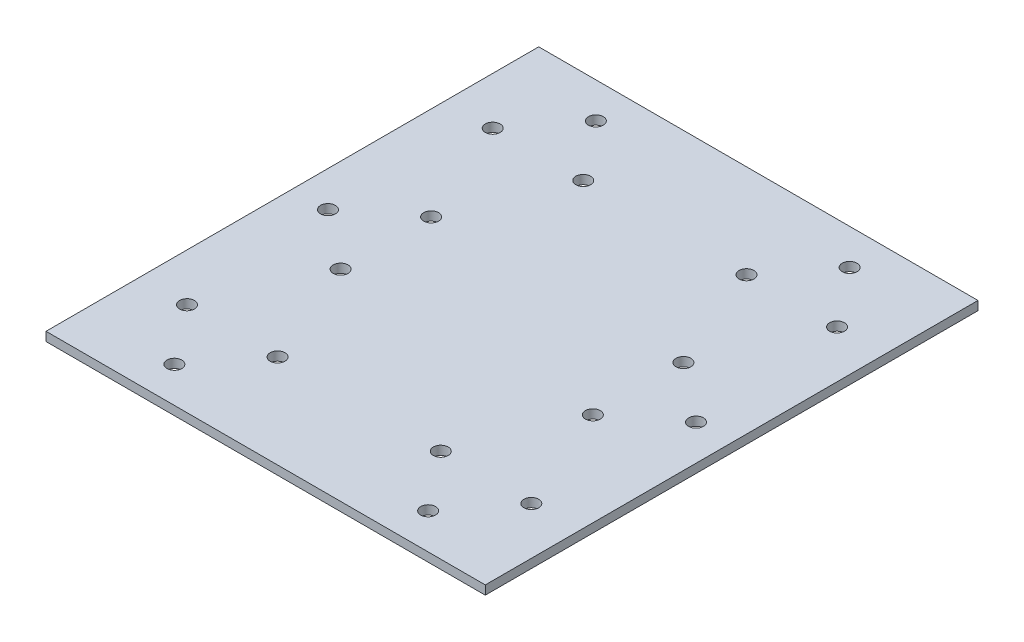
ISO-10303-21;
HEADER;
FILE_DESCRIPTION(('STEP AP214'),'2;1');
FILE_NAME('part.step','',(''),(''),'','','');
FILE_SCHEMA(('AUTOMOTIVE_DESIGN { 1 0 10303 214 1 1 1 1 }'));
ENDSEC;
DATA;
#1=APPLICATION_CONTEXT('core data for automotive mechanical design processes');
#2=APPLICATION_PROTOCOL_DEFINITION('international standard','automotive_design',2000,#1);
#3=PRODUCT_CONTEXT('',#1,'mechanical');
#4=PRODUCT('Part','Part','',(#3));
#5=PRODUCT_RELATED_PRODUCT_CATEGORY('part','',(#4));
#6=PRODUCT_DEFINITION_FORMATION('','',#4);
#7=PRODUCT_DEFINITION_CONTEXT('part definition',#1,'design');
#8=PRODUCT_DEFINITION('design','',#6,#7);
#9=PRODUCT_DEFINITION_SHAPE('','',#8);
#10=(LENGTH_UNIT() NAMED_UNIT(*) SI_UNIT(.MILLI.,.METRE.));
#11=(NAMED_UNIT(*) PLANE_ANGLE_UNIT() SI_UNIT($,.RADIAN.));
#12=(NAMED_UNIT(*) SI_UNIT($,.STERADIAN.) SOLID_ANGLE_UNIT());
#13=UNCERTAINTY_MEASURE_WITH_UNIT(LENGTH_MEASURE(1.E-05),#10,'distance_accuracy_value','');
#14=(GEOMETRIC_REPRESENTATION_CONTEXT(3) GLOBAL_UNCERTAINTY_ASSIGNED_CONTEXT((#13)) GLOBAL_UNIT_ASSIGNED_CONTEXT((#10,
#11,#12)) REPRESENTATION_CONTEXT('',''));
#15=CARTESIAN_POINT('',(0.,0.,0.));
#16=DIRECTION('',(0.,0.,1.));
#17=DIRECTION('',(1.,0.,0.));
#18=AXIS2_PLACEMENT_3D('',#15,#16,#17);
#19=CARTESIAN_POINT('',(-74.,3.,83.));
#20=DIRECTION('',(1.,0.,0.));
#21=DIRECTION('',(0.,0.,-1.));
#22=AXIS2_PLACEMENT_3D('',#19,#20,#21);
#23=PLANE('',#22);
#24=DIRECTION('',(0.,0.,1.));
#25=VECTOR('',#24,1.);
#26=CARTESIAN_POINT('',(-74.,0.,83.));
#27=LINE('',#26,#25);
#28=CARTESIAN_POINT('',(-74.,0.,-83.));
#29=VERTEX_POINT('',#28);
#30=CARTESIAN_POINT('',(-74.,0.,83.));
#31=VERTEX_POINT('',#30);
#32=EDGE_CURVE('E100',#29,#31,#27,.T.);
#33=ORIENTED_EDGE('',*,*,#32,.T.);
#34=DIRECTION('',(0.,-1.,0.));
#35=VECTOR('',#34,1.);
#36=CARTESIAN_POINT('',(-74.,3.,83.));
#37=LINE('',#36,#35);
#38=CARTESIAN_POINT('',(-74.,3.,83.));
#39=VERTEX_POINT('',#38);
#40=EDGE_CURVE('E11',#39,#31,#37,.T.);
#41=ORIENTED_EDGE('',*,*,#40,.F.);
#42=DIRECTION('',(0.,0.,1.));
#43=VECTOR('',#42,1.);
#44=CARTESIAN_POINT('',(-74.,3.,83.));
#45=LINE('',#44,#43);
#46=CARTESIAN_POINT('',(-74.,3.,-83.));
#47=VERTEX_POINT('',#46);
#48=EDGE_CURVE('E88',#47,#39,#45,.T.);
#49=ORIENTED_EDGE('',*,*,#48,.F.);
#50=DIRECTION('',(0.,-1.,0.));
#51=VECTOR('',#50,1.);
#52=CARTESIAN_POINT('',(-74.,3.,-83.));
#53=LINE('',#52,#51);
#54=EDGE_CURVE('E96',#47,#29,#53,.T.);
#55=ORIENTED_EDGE('',*,*,#54,.T.);
#56=EDGE_LOOP('',(#33,#41,#49,#55));
#57=FACE_BOUND('',#56,.T.);
#58=ADVANCED_FACE('F37',(#57),#23,.F.);
#59=CARTESIAN_POINT('',(74.,3.,83.));
#60=DIRECTION('',(0.,0.,-1.));
#61=DIRECTION('',(-1.,0.,0.));
#62=AXIS2_PLACEMENT_3D('',#59,#60,#61);
#63=PLANE('',#62);
#64=DIRECTION('',(1.,0.,0.));
#65=VECTOR('',#64,1.);
#66=CARTESIAN_POINT('',(74.,0.,83.));
#67=LINE('',#66,#65);
#68=CARTESIAN_POINT('',(74.,0.,83.));
#69=VERTEX_POINT('',#68);
#70=EDGE_CURVE('E92',#31,#69,#67,.T.);
#71=ORIENTED_EDGE('',*,*,#70,.T.);
#72=DIRECTION('',(0.,-1.,0.));
#73=VECTOR('',#72,1.);
#74=CARTESIAN_POINT('',(74.,3.,83.));
#75=LINE('',#74,#73);
#76=CARTESIAN_POINT('',(74.,3.,83.));
#77=VERTEX_POINT('',#76);
#78=EDGE_CURVE('E45',#77,#69,#75,.T.);
#79=ORIENTED_EDGE('',*,*,#78,.F.);
#80=DIRECTION('',(1.,0.,0.));
#81=VECTOR('',#80,1.);
#82=CARTESIAN_POINT('',(74.,3.,83.));
#83=LINE('',#82,#81);
#84=EDGE_CURVE('E83',#39,#77,#83,.T.);
#85=ORIENTED_EDGE('',*,*,#84,.F.);
#86=ORIENTED_EDGE('',*,*,#40,.T.);
#87=EDGE_LOOP('',(#71,#79,#85,#86));
#88=FACE_BOUND('',#87,.T.);
#89=ADVANCED_FACE('F91',(#88),#63,.F.);
#90=CARTESIAN_POINT('',(74.,3.,83.));
#91=DIRECTION('',(-1.,0.,0.));
#92=DIRECTION('',(0.,0.,1.));
#93=AXIS2_PLACEMENT_3D('',#90,#91,#92);
#94=PLANE('',#93);
#95=DIRECTION('',(0.,0.,-1.));
#96=VECTOR('',#95,1.);
#97=CARTESIAN_POINT('',(74.,0.,83.));
#98=LINE('',#97,#96);
#99=CARTESIAN_POINT('',(74.,0.,-83.));
#100=VERTEX_POINT('',#99);
#101=EDGE_CURVE('E70',#69,#100,#98,.T.);
#102=ORIENTED_EDGE('',*,*,#101,.T.);
#103=DIRECTION('',(0.,-1.,0.));
#104=VECTOR('',#103,1.);
#105=CARTESIAN_POINT('',(74.,3.,-83.));
#106=LINE('',#105,#104);
#107=CARTESIAN_POINT('',(74.,3.,-83.));
#108=VERTEX_POINT('',#107);
#109=EDGE_CURVE('E93',#108,#100,#106,.T.);
#110=ORIENTED_EDGE('',*,*,#109,.F.);
#111=DIRECTION('',(0.,0.,-1.));
#112=VECTOR('',#111,1.);
#113=CARTESIAN_POINT('',(74.,3.,83.));
#114=LINE('',#113,#112);
#115=EDGE_CURVE('E86',#77,#108,#114,.T.);
#116=ORIENTED_EDGE('',*,*,#115,.F.);
#117=ORIENTED_EDGE('',*,*,#78,.T.);
#118=EDGE_LOOP('',(#102,#110,#116,#117));
#119=FACE_BOUND('',#118,.T.);
#120=ADVANCED_FACE('F94',(#119),#94,.F.);
#121=CARTESIAN_POINT('',(74.,3.,-83.));
#122=DIRECTION('',(0.,0.,1.));
#123=DIRECTION('',(1.,0.,0.));
#124=AXIS2_PLACEMENT_3D('',#121,#122,#123);
#125=PLANE('',#124);
#126=DIRECTION('',(-1.,0.,0.));
#127=VECTOR('',#126,1.);
#128=CARTESIAN_POINT('',(74.,0.,-83.));
#129=LINE('',#128,#127);
#130=EDGE_CURVE('E76',#100,#29,#129,.T.);
#131=ORIENTED_EDGE('',*,*,#130,.T.);
#132=ORIENTED_EDGE('',*,*,#54,.F.);
#133=DIRECTION('',(-1.,0.,0.));
#134=VECTOR('',#133,1.);
#135=CARTESIAN_POINT('',(74.,3.,-83.));
#136=LINE('',#135,#134);
#137=EDGE_CURVE('E53',#108,#47,#136,.T.);
#138=ORIENTED_EDGE('',*,*,#137,.F.);
#139=ORIENTED_EDGE('',*,*,#109,.T.);
#140=EDGE_LOOP('',(#131,#132,#138,#139));
#141=FACE_BOUND('',#140,.T.);
#142=ADVANCED_FACE('F108',(#141),#125,.F.);
#143=CARTESIAN_POINT('',(0.,3.,0.));
#144=DIRECTION('',(0.,1.,0.));
#145=DIRECTION('',(0.,0.,1.));
#146=AXIS2_PLACEMENT_3D('',#143,#144,#145);
#147=PLANE('',#146);
#148=CARTESIAN_POINT('',(27.5,3.,-51.5));
#149=DIRECTION('',(0.,1.,0.));
#150=DIRECTION('',(0.,0.,-1.));
#151=AXIS2_PLACEMENT_3D('',#148,#149,#150);
#152=CIRCLE('',#151,2.5);
#153=CARTESIAN_POINT('',(27.5,3.,-54.));
#154=VERTEX_POINT('',#153);
#155=EDGE_CURVE('E187',#154,#154,#152,.T.);
#156=ORIENTED_EDGE('',*,*,#155,.F.);
#157=EDGE_LOOP('',(#156));
#158=FACE_BOUND('',#157,.T.);
#159=CARTESIAN_POINT('',(58.,3.,-51.5));
#160=DIRECTION('',(0.,1.,0.));
#161=DIRECTION('',(0.,0.,-1.));
#162=AXIS2_PLACEMENT_3D('',#159,#160,#161);
#163=CIRCLE('',#162,2.5);
#164=CARTESIAN_POINT('',(58.,3.,-54.));
#165=VERTEX_POINT('',#164);
#166=EDGE_CURVE('E181',#165,#165,#163,.T.);
#167=ORIENTED_EDGE('',*,*,#166,.F.);
#168=EDGE_LOOP('',(#167));
#169=FACE_BOUND('',#168,.T.);
#170=CARTESIAN_POINT('',(-42.75,3.,-71.));
#171=DIRECTION('',(0.,1.,0.));
#172=DIRECTION('',(0.,0.,1.));
#173=AXIS2_PLACEMENT_3D('',#170,#171,#172);
#174=CIRCLE('',#173,2.5);
#175=CARTESIAN_POINT('',(-42.75,3.,-68.5));
#176=VERTEX_POINT('',#175);
#177=EDGE_CURVE('E175',#176,#176,#174,.T.);
#178=ORIENTED_EDGE('',*,*,#177,.F.);
#179=EDGE_LOOP('',(#178));
#180=FACE_BOUND('',#179,.T.);
#181=CARTESIAN_POINT('',(-42.75,3.,71.));
#182=DIRECTION('',(0.,1.,0.));
#183=DIRECTION('',(0.,0.,-1.));
#184=AXIS2_PLACEMENT_3D('',#181,#182,#183);
#185=CIRCLE('',#184,2.49999999999999);
#186=CARTESIAN_POINT('',(-42.75,3.,68.5));
#187=VERTEX_POINT('',#186);
#188=EDGE_CURVE('E168',#187,#187,#185,.T.);
#189=ORIENTED_EDGE('',*,*,#188,.F.);
#190=EDGE_LOOP('',(#189));
#191=FACE_BOUND('',#190,.T.);
#192=CARTESIAN_POINT('',(42.75,3.,-71.));
#193=DIRECTION('',(0.,1.,0.));
#194=DIRECTION('',(0.,0.,-1.));
#195=AXIS2_PLACEMENT_3D('',#192,#193,#194);
#196=CIRCLE('',#195,2.5);
#197=CARTESIAN_POINT('',(42.75,3.,-73.5));
#198=VERTEX_POINT('',#197);
#199=EDGE_CURVE('E204',#198,#198,#196,.T.);
#200=ORIENTED_EDGE('',*,*,#199,.F.);
#201=EDGE_LOOP('',(#200));
#202=FACE_BOUND('',#201,.T.);
#203=CARTESIAN_POINT('',(42.75,3.,71.));
#204=DIRECTION('',(0.,1.,0.));
#205=DIRECTION('',(0.,0.,1.));
#206=AXIS2_PLACEMENT_3D('',#203,#204,#205);
#207=CIRCLE('',#206,2.49999999999999);
#208=CARTESIAN_POINT('',(42.75,3.,73.5));
#209=VERTEX_POINT('',#208);
#210=EDGE_CURVE('E211',#209,#209,#207,.T.);
#211=ORIENTED_EDGE('',*,*,#210,.F.);
#212=EDGE_LOOP('',(#211));
#213=FACE_BOUND('',#212,.T.);
#214=CARTESIAN_POINT('',(42.5,3.,15.25));
#215=DIRECTION('',(0.,1.,0.));
#216=DIRECTION('',(0.,0.,-1.));
#217=AXIS2_PLACEMENT_3D('',#214,#215,#216);
#218=CIRCLE('',#217,2.5);
#219=CARTESIAN_POINT('',(42.5,3.,12.75));
#220=VERTEX_POINT('',#219);
#221=EDGE_CURVE('E192',#220,#220,#218,.T.);
#222=ORIENTED_EDGE('',*,*,#221,.F.);
#223=EDGE_LOOP('',(#222));
#224=FACE_BOUND('',#223,.T.);
#225=CARTESIAN_POINT('',(42.5,3.,-15.25));
#226=DIRECTION('',(0.,1.,0.));
#227=DIRECTION('',(0.,0.,-1.));
#228=AXIS2_PLACEMENT_3D('',#225,#226,#227);
#229=CIRCLE('',#228,2.49999999999999);
#230=CARTESIAN_POINT('',(42.5,3.,-17.75));
#231=VERTEX_POINT('',#230);
#232=EDGE_CURVE('E199',#231,#231,#229,.T.);
#233=ORIENTED_EDGE('',*,*,#232,.F.);
#234=EDGE_LOOP('',(#233));
#235=FACE_BOUND('',#234,.T.);
#236=CARTESIAN_POINT('',(27.5,3.,51.5));
#237=DIRECTION('',(0.,1.,0.));
#238=DIRECTION('',(0.,0.,1.));
#239=AXIS2_PLACEMENT_3D('',#236,#237,#238);
#240=CIRCLE('',#239,2.5);
#241=CARTESIAN_POINT('',(27.5,3.,54.));
#242=VERTEX_POINT('',#241);
#243=EDGE_CURVE('E120',#242,#242,#240,.T.);
#244=ORIENTED_EDGE('',*,*,#243,.F.);
#245=EDGE_LOOP('',(#244));
#246=FACE_BOUND('',#245,.T.);
#247=CARTESIAN_POINT('',(58.,3.,51.5));
#248=DIRECTION('',(0.,1.,0.));
#249=DIRECTION('',(0.,0.,1.));
#250=AXIS2_PLACEMENT_3D('',#247,#248,#249);
#251=CIRCLE('',#250,2.5);
#252=CARTESIAN_POINT('',(58.,3.,54.));
#253=VERTEX_POINT('',#252);
#254=EDGE_CURVE('E127',#253,#253,#251,.T.);
#255=ORIENTED_EDGE('',*,*,#254,.F.);
#256=EDGE_LOOP('',(#255));
#257=FACE_BOUND('',#256,.T.);
#258=CARTESIAN_POINT('',(-58.,3.,51.5));
#259=DIRECTION('',(0.,1.,0.));
#260=DIRECTION('',(0.,0.,-1.));
#261=AXIS2_PLACEMENT_3D('',#258,#259,#260);
#262=CIRCLE('',#261,2.5);
#263=CARTESIAN_POINT('',(-58.,3.,49.));
#264=VERTEX_POINT('',#263);
#265=EDGE_CURVE('E133',#264,#264,#262,.T.);
#266=ORIENTED_EDGE('',*,*,#265,.F.);
#267=EDGE_LOOP('',(#266));
#268=FACE_BOUND('',#267,.T.);
#269=CARTESIAN_POINT('',(-27.5,3.,51.5));
#270=DIRECTION('',(0.,1.,0.));
#271=DIRECTION('',(0.,0.,-1.));
#272=AXIS2_PLACEMENT_3D('',#269,#270,#271);
#273=CIRCLE('',#272,2.5);
#274=CARTESIAN_POINT('',(-27.5,3.,49.));
#275=VERTEX_POINT('',#274);
#276=EDGE_CURVE('E139',#275,#275,#273,.T.);
#277=ORIENTED_EDGE('',*,*,#276,.F.);
#278=EDGE_LOOP('',(#277));
#279=FACE_BOUND('',#278,.T.);
#280=CARTESIAN_POINT('',(-27.5,3.,-51.5));
#281=DIRECTION('',(0.,1.,0.));
#282=DIRECTION('',(0.,0.,1.));
#283=AXIS2_PLACEMENT_3D('',#280,#281,#282);
#284=CIRCLE('',#283,2.50000000000001);
#285=CARTESIAN_POINT('',(-27.5,3.,-49.));
#286=VERTEX_POINT('',#285);
#287=EDGE_CURVE('E153',#286,#286,#284,.T.);
#288=ORIENTED_EDGE('',*,*,#287,.F.);
#289=EDGE_LOOP('',(#288));
#290=FACE_BOUND('',#289,.T.);
#291=CARTESIAN_POINT('',(-62.,3.,0.));
#292=DIRECTION('',(0.,1.,0.));
#293=DIRECTION('',(0.,0.,1.));
#294=AXIS2_PLACEMENT_3D('',#291,#292,#293);
#295=CIRCLE('',#294,2.5);
#296=CARTESIAN_POINT('',(-62.,3.,2.49999999999999));
#297=VERTEX_POINT('',#296);
#298=EDGE_CURVE('E146',#297,#297,#295,.T.);
#299=ORIENTED_EDGE('',*,*,#298,.F.);
#300=EDGE_LOOP('',(#299));
#301=FACE_BOUND('',#300,.T.);
#302=CARTESIAN_POINT('',(-42.5,3.,15.25));
#303=DIRECTION('',(0.,1.,0.));
#304=DIRECTION('',(0.,0.,1.));
#305=AXIS2_PLACEMENT_3D('',#302,#303,#304);
#306=CIRCLE('',#305,2.5);
#307=CARTESIAN_POINT('',(-42.5,3.,17.75));
#308=VERTEX_POINT('',#307);
#309=EDGE_CURVE('E163',#308,#308,#306,.T.);
#310=ORIENTED_EDGE('',*,*,#309,.F.);
#311=EDGE_LOOP('',(#310));
#312=FACE_BOUND('',#311,.T.);
#313=CARTESIAN_POINT('',(-42.5,3.,-15.25));
#314=DIRECTION('',(0.,1.,0.));
#315=DIRECTION('',(0.,0.,1.));
#316=AXIS2_PLACEMENT_3D('',#313,#314,#315);
#317=CIRCLE('',#316,2.49999999999999);
#318=CARTESIAN_POINT('',(-42.5,3.,-12.75));
#319=VERTEX_POINT('',#318);
#320=EDGE_CURVE('E145',#319,#319,#317,.T.);
#321=ORIENTED_EDGE('',*,*,#320,.F.);
#322=EDGE_LOOP('',(#321));
#323=FACE_BOUND('',#322,.T.);
#324=CARTESIAN_POINT('',(62.,3.,0.));
#325=DIRECTION('',(0.,1.,0.));
#326=DIRECTION('',(0.,0.,-1.));
#327=AXIS2_PLACEMENT_3D('',#324,#325,#326);
#328=CIRCLE('',#327,2.49999999999999);
#329=CARTESIAN_POINT('',(62.,3.,-2.50000000000001));
#330=VERTEX_POINT('',#329);
#331=EDGE_CURVE('E216',#330,#330,#328,.T.);
#332=ORIENTED_EDGE('',*,*,#331,.F.);
#333=EDGE_LOOP('',(#332));
#334=FACE_BOUND('',#333,.T.);
#335=CARTESIAN_POINT('',(-58.,3.,-51.5));
#336=DIRECTION('',(0.,1.,0.));
#337=DIRECTION('',(0.,0.,1.));
#338=AXIS2_PLACEMENT_3D('',#335,#336,#337);
#339=CIRCLE('',#338,2.5);
#340=CARTESIAN_POINT('',(-58.,3.,-49.));
#341=VERTEX_POINT('',#340);
#342=EDGE_CURVE('E114',#341,#341,#339,.T.);
#343=ORIENTED_EDGE('',*,*,#342,.F.);
#344=EDGE_LOOP('',(#343));
#345=FACE_BOUND('',#344,.T.);
#346=ORIENTED_EDGE('',*,*,#48,.T.);
#347=ORIENTED_EDGE('',*,*,#84,.T.);
#348=ORIENTED_EDGE('',*,*,#115,.T.);
#349=ORIENTED_EDGE('',*,*,#137,.T.);
#350=EDGE_LOOP('',(#346,#347,#348,#349));
#351=FACE_BOUND('',#350,.T.);
#352=ADVANCED_FACE('F84',(#158,#169,#180,#191,#202,#213,#224,#235,#246,#257,#268,#279,#290,#301,
#312,#323,#334,#345,#351),#147,.T.);
#353=CARTESIAN_POINT('',(0.,0.,0.));
#354=DIRECTION('',(0.,1.,0.));
#355=DIRECTION('',(0.,0.,1.));
#356=AXIS2_PLACEMENT_3D('',#353,#354,#355);
#357=PLANE('',#356);
#358=CARTESIAN_POINT('',(27.5,0.,-51.5));
#359=DIRECTION('',(0.,1.,0.));
#360=DIRECTION('',(0.,0.,-1.));
#361=AXIS2_PLACEMENT_3D('',#358,#359,#360);
#362=CIRCLE('',#361,2.5);
#363=CARTESIAN_POINT('',(27.5,0.,-54.));
#364=VERTEX_POINT('',#363);
#365=EDGE_CURVE('E124',#364,#364,#362,.T.);
#366=ORIENTED_EDGE('',*,*,#365,.T.);
#367=EDGE_LOOP('',(#366));
#368=FACE_BOUND('',#367,.T.);
#369=CARTESIAN_POINT('',(58.,0.,-51.5));
#370=DIRECTION('',(0.,1.,0.));
#371=DIRECTION('',(0.,0.,-1.));
#372=AXIS2_PLACEMENT_3D('',#369,#370,#371);
#373=CIRCLE('',#372,2.5);
#374=CARTESIAN_POINT('',(58.,0.,-54.));
#375=VERTEX_POINT('',#374);
#376=EDGE_CURVE('E184',#375,#375,#373,.T.);
#377=ORIENTED_EDGE('',*,*,#376,.T.);
#378=EDGE_LOOP('',(#377));
#379=FACE_BOUND('',#378,.T.);
#380=CARTESIAN_POINT('',(-42.75,0.,-71.));
#381=DIRECTION('',(0.,1.,0.));
#382=DIRECTION('',(0.,0.,1.));
#383=AXIS2_PLACEMENT_3D('',#380,#381,#382);
#384=CIRCLE('',#383,2.5);
#385=CARTESIAN_POINT('',(-42.75,0.,-68.5));
#386=VERTEX_POINT('',#385);
#387=EDGE_CURVE('E178',#386,#386,#384,.T.);
#388=ORIENTED_EDGE('',*,*,#387,.T.);
#389=EDGE_LOOP('',(#388));
#390=FACE_BOUND('',#389,.T.);
#391=CARTESIAN_POINT('',(-42.75,0.,71.));
#392=DIRECTION('',(0.,1.,0.));
#393=DIRECTION('',(0.,0.,-1.));
#394=AXIS2_PLACEMENT_3D('',#391,#392,#393);
#395=CIRCLE('',#394,2.49999999999999);
#396=CARTESIAN_POINT('',(-42.75,0.,68.5));
#397=VERTEX_POINT('',#396);
#398=EDGE_CURVE('E171',#397,#397,#395,.T.);
#399=ORIENTED_EDGE('',*,*,#398,.T.);
#400=EDGE_LOOP('',(#399));
#401=FACE_BOUND('',#400,.T.);
#402=CARTESIAN_POINT('',(42.75,0.,-71.));
#403=DIRECTION('',(0.,1.,0.));
#404=DIRECTION('',(0.,0.,-1.));
#405=AXIS2_PLACEMENT_3D('',#402,#403,#404);
#406=CIRCLE('',#405,2.5);
#407=CARTESIAN_POINT('',(42.75,0.,-73.5));
#408=VERTEX_POINT('',#407);
#409=EDGE_CURVE('E207',#408,#408,#406,.T.);
#410=ORIENTED_EDGE('',*,*,#409,.T.);
#411=EDGE_LOOP('',(#410));
#412=FACE_BOUND('',#411,.T.);
#413=CARTESIAN_POINT('',(42.75,0.,71.));
#414=DIRECTION('',(0.,1.,0.));
#415=DIRECTION('',(0.,0.,1.));
#416=AXIS2_PLACEMENT_3D('',#413,#414,#415);
#417=CIRCLE('',#416,2.49999999999999);
#418=CARTESIAN_POINT('',(42.75,0.,73.5));
#419=VERTEX_POINT('',#418);
#420=EDGE_CURVE('E196',#419,#419,#417,.T.);
#421=ORIENTED_EDGE('',*,*,#420,.T.);
#422=EDGE_LOOP('',(#421));
#423=FACE_BOUND('',#422,.T.);
#424=CARTESIAN_POINT('',(42.5,0.,15.25));
#425=DIRECTION('',(0.,1.,0.));
#426=DIRECTION('',(0.,0.,-1.));
#427=AXIS2_PLACEMENT_3D('',#424,#425,#426);
#428=CIRCLE('',#427,2.5);
#429=CARTESIAN_POINT('',(42.5,0.,12.75));
#430=VERTEX_POINT('',#429);
#431=EDGE_CURVE('E195',#430,#430,#428,.T.);
#432=ORIENTED_EDGE('',*,*,#431,.T.);
#433=EDGE_LOOP('',(#432));
#434=FACE_BOUND('',#433,.T.);
#435=CARTESIAN_POINT('',(42.5,0.,-15.25));
#436=DIRECTION('',(0.,1.,0.));
#437=DIRECTION('',(0.,0.,-1.));
#438=AXIS2_PLACEMENT_3D('',#435,#436,#437);
#439=CIRCLE('',#438,2.49999999999999);
#440=CARTESIAN_POINT('',(42.5,0.,-17.75));
#441=VERTEX_POINT('',#440);
#442=EDGE_CURVE('E172',#441,#441,#439,.T.);
#443=ORIENTED_EDGE('',*,*,#442,.T.);
#444=EDGE_LOOP('',(#443));
#445=FACE_BOUND('',#444,.T.);
#446=CARTESIAN_POINT('',(27.5,0.,51.5));
#447=DIRECTION('',(0.,1.,0.));
#448=DIRECTION('',(0.,0.,1.));
#449=AXIS2_PLACEMENT_3D('',#446,#447,#448);
#450=CIRCLE('',#449,2.5);
#451=CARTESIAN_POINT('',(27.5,0.,54.));
#452=VERTEX_POINT('',#451);
#453=EDGE_CURVE('E123',#452,#452,#450,.T.);
#454=ORIENTED_EDGE('',*,*,#453,.T.);
#455=EDGE_LOOP('',(#454));
#456=FACE_BOUND('',#455,.T.);
#457=CARTESIAN_POINT('',(58.,0.,51.5));
#458=DIRECTION('',(0.,1.,0.));
#459=DIRECTION('',(0.,0.,1.));
#460=AXIS2_PLACEMENT_3D('',#457,#458,#459);
#461=CIRCLE('',#460,2.5);
#462=CARTESIAN_POINT('',(58.,0.,54.));
#463=VERTEX_POINT('',#462);
#464=EDGE_CURVE('E130',#463,#463,#461,.T.);
#465=ORIENTED_EDGE('',*,*,#464,.T.);
#466=EDGE_LOOP('',(#465));
#467=FACE_BOUND('',#466,.T.);
#468=CARTESIAN_POINT('',(-58.,0.,51.5));
#469=DIRECTION('',(0.,1.,0.));
#470=DIRECTION('',(0.,0.,-1.));
#471=AXIS2_PLACEMENT_3D('',#468,#469,#470);
#472=CIRCLE('',#471,2.5);
#473=CARTESIAN_POINT('',(-58.,0.,49.));
#474=VERTEX_POINT('',#473);
#475=EDGE_CURVE('E136',#474,#474,#472,.T.);
#476=ORIENTED_EDGE('',*,*,#475,.T.);
#477=EDGE_LOOP('',(#476));
#478=FACE_BOUND('',#477,.T.);
#479=CARTESIAN_POINT('',(-27.5,0.,51.5));
#480=DIRECTION('',(0.,1.,0.));
#481=DIRECTION('',(0.,0.,-1.));
#482=AXIS2_PLACEMENT_3D('',#479,#480,#481);
#483=CIRCLE('',#482,2.5);
#484=CARTESIAN_POINT('',(-27.5,0.,49.));
#485=VERTEX_POINT('',#484);
#486=EDGE_CURVE('E142',#485,#485,#483,.T.);
#487=ORIENTED_EDGE('',*,*,#486,.T.);
#488=EDGE_LOOP('',(#487));
#489=FACE_BOUND('',#488,.T.);
#490=CARTESIAN_POINT('',(-27.5,0.,-51.5));
#491=DIRECTION('',(0.,1.,0.));
#492=DIRECTION('',(0.,0.,1.));
#493=AXIS2_PLACEMENT_3D('',#490,#491,#492);
#494=CIRCLE('',#493,2.50000000000001);
#495=CARTESIAN_POINT('',(-27.5,0.,-49.));
#496=VERTEX_POINT('',#495);
#497=EDGE_CURVE('E117',#496,#496,#494,.T.);
#498=ORIENTED_EDGE('',*,*,#497,.T.);
#499=EDGE_LOOP('',(#498));
#500=FACE_BOUND('',#499,.T.);
#501=CARTESIAN_POINT('',(-62.,0.,0.));
#502=DIRECTION('',(0.,1.,0.));
#503=DIRECTION('',(0.,0.,1.));
#504=AXIS2_PLACEMENT_3D('',#501,#502,#503);
#505=CIRCLE('',#504,2.5);
#506=CARTESIAN_POINT('',(-62.,0.,2.49999999999999));
#507=VERTEX_POINT('',#506);
#508=EDGE_CURVE('E149',#507,#507,#505,.T.);
#509=ORIENTED_EDGE('',*,*,#508,.T.);
#510=EDGE_LOOP('',(#509));
#511=FACE_BOUND('',#510,.T.);
#512=CARTESIAN_POINT('',(-42.5,0.,15.25));
#513=DIRECTION('',(0.,1.,0.));
#514=DIRECTION('',(0.,0.,1.));
#515=AXIS2_PLACEMENT_3D('',#512,#513,#514);
#516=CIRCLE('',#515,2.5);
#517=CARTESIAN_POINT('',(-42.5,0.,17.75));
#518=VERTEX_POINT('',#517);
#519=EDGE_CURVE('E150',#518,#518,#516,.T.);
#520=ORIENTED_EDGE('',*,*,#519,.T.);
#521=EDGE_LOOP('',(#520));
#522=FACE_BOUND('',#521,.T.);
#523=CARTESIAN_POINT('',(-42.5,0.,-15.25));
#524=DIRECTION('',(0.,1.,0.));
#525=DIRECTION('',(0.,0.,1.));
#526=AXIS2_PLACEMENT_3D('',#523,#524,#525);
#527=CIRCLE('',#526,2.49999999999999);
#528=CARTESIAN_POINT('',(-42.5,0.,-12.75));
#529=VERTEX_POINT('',#528);
#530=EDGE_CURVE('E160',#529,#529,#527,.T.);
#531=ORIENTED_EDGE('',*,*,#530,.T.);
#532=EDGE_LOOP('',(#531));
#533=FACE_BOUND('',#532,.T.);
#534=CARTESIAN_POINT('',(62.,0.,0.));
#535=DIRECTION('',(0.,1.,0.));
#536=DIRECTION('',(0.,0.,-1.));
#537=AXIS2_PLACEMENT_3D('',#534,#535,#536);
#538=CIRCLE('',#537,2.49999999999999);
#539=CARTESIAN_POINT('',(62.,0.,-2.50000000000001));
#540=VERTEX_POINT('',#539);
#541=EDGE_CURVE('E208',#540,#540,#538,.T.);
#542=ORIENTED_EDGE('',*,*,#541,.T.);
#543=EDGE_LOOP('',(#542));
#544=FACE_BOUND('',#543,.T.);
#545=CARTESIAN_POINT('',(-58.,0.,-51.5));
#546=DIRECTION('',(0.,1.,0.));
#547=DIRECTION('',(0.,0.,1.));
#548=AXIS2_PLACEMENT_3D('',#545,#546,#547);
#549=CIRCLE('',#548,2.5);
#550=CARTESIAN_POINT('',(-58.,0.,-49.));
#551=VERTEX_POINT('',#550);
#552=EDGE_CURVE('E103',#551,#551,#549,.T.);
#553=ORIENTED_EDGE('',*,*,#552,.T.);
#554=EDGE_LOOP('',(#553));
#555=FACE_BOUND('',#554,.T.);
#556=ORIENTED_EDGE('',*,*,#32,.F.);
#557=ORIENTED_EDGE('',*,*,#130,.F.);
#558=ORIENTED_EDGE('',*,*,#101,.F.);
#559=ORIENTED_EDGE('',*,*,#70,.F.);
#560=EDGE_LOOP('',(#556,#557,#558,#559));
#561=FACE_BOUND('',#560,.T.);
#562=ADVANCED_FACE('F111',(#368,#379,#390,#401,#412,#423,#434,#445,#456,#467,#478,#489,#500,
#511,#522,#533,#544,#555,#561),#357,.F.);
#563=CARTESIAN_POINT('',(-58.,0.,-51.5));
#564=DIRECTION('',(0.,1.,0.));
#565=DIRECTION('',(0.,0.,1.));
#566=AXIS2_PLACEMENT_3D('',#563,#564,#565);
#567=CYLINDRICAL_SURFACE('',#566,2.5);
#568=ORIENTED_EDGE('',*,*,#552,.F.);
#569=EDGE_LOOP('',(#568));
#570=FACE_BOUND('',#569,.T.);
#571=ORIENTED_EDGE('',*,*,#342,.T.);
#572=EDGE_LOOP('',(#571));
#573=FACE_BOUND('',#572,.T.);
#574=ADVANCED_FACE('F228',(#570,#573),#567,.F.);
#575=CARTESIAN_POINT('',(62.,0.,0.));
#576=DIRECTION('',(0.,1.,0.));
#577=DIRECTION('',(0.,0.,1.));
#578=AXIS2_PLACEMENT_3D('',#575,#576,#577);
#579=CYLINDRICAL_SURFACE('',#578,2.49999999999999);
#580=ORIENTED_EDGE('',*,*,#541,.F.);
#581=EDGE_LOOP('',(#580));
#582=FACE_BOUND('',#581,.T.);
#583=ORIENTED_EDGE('',*,*,#331,.T.);
#584=EDGE_LOOP('',(#583));
#585=FACE_BOUND('',#584,.T.);
#586=ADVANCED_FACE('F224',(#582,#585),#579,.F.);
#587=CARTESIAN_POINT('',(-42.5,0.,-15.25));
#588=DIRECTION('',(0.,1.,0.));
#589=DIRECTION('',(0.,0.,1.));
#590=AXIS2_PLACEMENT_3D('',#587,#588,#589);
#591=CYLINDRICAL_SURFACE('',#590,2.49999999999999);
#592=ORIENTED_EDGE('',*,*,#530,.F.);
#593=EDGE_LOOP('',(#592));
#594=FACE_BOUND('',#593,.T.);
#595=ORIENTED_EDGE('',*,*,#320,.T.);
#596=EDGE_LOOP('',(#595));
#597=FACE_BOUND('',#596,.T.);
#598=ADVANCED_FACE('F227',(#594,#597),#591,.F.);
#599=CARTESIAN_POINT('',(-42.5,0.,15.25));
#600=DIRECTION('',(0.,1.,0.));
#601=DIRECTION('',(0.,0.,1.));
#602=AXIS2_PLACEMENT_3D('',#599,#600,#601);
#603=CYLINDRICAL_SURFACE('',#602,2.5);
#604=ORIENTED_EDGE('',*,*,#519,.F.);
#605=EDGE_LOOP('',(#604));
#606=FACE_BOUND('',#605,.T.);
#607=ORIENTED_EDGE('',*,*,#309,.T.);
#608=EDGE_LOOP('',(#607));
#609=FACE_BOUND('',#608,.T.);
#610=ADVANCED_FACE('F289',(#606,#609),#603,.F.);
#611=CARTESIAN_POINT('',(-62.,0.,0.));
#612=DIRECTION('',(0.,1.,0.));
#613=DIRECTION('',(0.,0.,1.));
#614=AXIS2_PLACEMENT_3D('',#611,#612,#613);
#615=CYLINDRICAL_SURFACE('',#614,2.5);
#616=ORIENTED_EDGE('',*,*,#508,.F.);
#617=EDGE_LOOP('',(#616));
#618=FACE_BOUND('',#617,.T.);
#619=ORIENTED_EDGE('',*,*,#298,.T.);
#620=EDGE_LOOP('',(#619));
#621=FACE_BOUND('',#620,.T.);
#622=ADVANCED_FACE('F299',(#618,#621),#615,.F.);
#623=CARTESIAN_POINT('',(-27.5,0.,-51.5));
#624=DIRECTION('',(0.,1.,0.));
#625=DIRECTION('',(0.,0.,1.));
#626=AXIS2_PLACEMENT_3D('',#623,#624,#625);
#627=CYLINDRICAL_SURFACE('',#626,2.50000000000001);
#628=ORIENTED_EDGE('',*,*,#497,.F.);
#629=EDGE_LOOP('',(#628));
#630=FACE_BOUND('',#629,.T.);
#631=ORIENTED_EDGE('',*,*,#287,.T.);
#632=EDGE_LOOP('',(#631));
#633=FACE_BOUND('',#632,.T.);
#634=ADVANCED_FACE('F309',(#630,#633),#627,.F.);
#635=CARTESIAN_POINT('',(-27.5,0.,51.5));
#636=DIRECTION('',(0.,1.,0.));
#637=DIRECTION('',(0.,0.,1.));
#638=AXIS2_PLACEMENT_3D('',#635,#636,#637);
#639=CYLINDRICAL_SURFACE('',#638,2.5);
#640=ORIENTED_EDGE('',*,*,#486,.F.);
#641=EDGE_LOOP('',(#640));
#642=FACE_BOUND('',#641,.T.);
#643=ORIENTED_EDGE('',*,*,#276,.T.);
#644=EDGE_LOOP('',(#643));
#645=FACE_BOUND('',#644,.T.);
#646=ADVANCED_FACE('F319',(#642,#645),#639,.F.);
#647=CARTESIAN_POINT('',(-58.,0.,51.5));
#648=DIRECTION('',(0.,1.,0.));
#649=DIRECTION('',(0.,0.,1.));
#650=AXIS2_PLACEMENT_3D('',#647,#648,#649);
#651=CYLINDRICAL_SURFACE('',#650,2.5);
#652=ORIENTED_EDGE('',*,*,#475,.F.);
#653=EDGE_LOOP('',(#652));
#654=FACE_BOUND('',#653,.T.);
#655=ORIENTED_EDGE('',*,*,#265,.T.);
#656=EDGE_LOOP('',(#655));
#657=FACE_BOUND('',#656,.T.);
#658=ADVANCED_FACE('F329',(#654,#657),#651,.F.);
#659=CARTESIAN_POINT('',(58.,0.,51.5));
#660=DIRECTION('',(0.,1.,0.));
#661=DIRECTION('',(0.,0.,1.));
#662=AXIS2_PLACEMENT_3D('',#659,#660,#661);
#663=CYLINDRICAL_SURFACE('',#662,2.5);
#664=ORIENTED_EDGE('',*,*,#464,.F.);
#665=EDGE_LOOP('',(#664));
#666=FACE_BOUND('',#665,.T.);
#667=ORIENTED_EDGE('',*,*,#254,.T.);
#668=EDGE_LOOP('',(#667));
#669=FACE_BOUND('',#668,.T.);
#670=ADVANCED_FACE('F339',(#666,#669),#663,.F.);
#671=CARTESIAN_POINT('',(27.5,0.,51.5));
#672=DIRECTION('',(0.,1.,0.));
#673=DIRECTION('',(0.,0.,1.));
#674=AXIS2_PLACEMENT_3D('',#671,#672,#673);
#675=CYLINDRICAL_SURFACE('',#674,2.5);
#676=ORIENTED_EDGE('',*,*,#453,.F.);
#677=EDGE_LOOP('',(#676));
#678=FACE_BOUND('',#677,.T.);
#679=ORIENTED_EDGE('',*,*,#243,.T.);
#680=EDGE_LOOP('',(#679));
#681=FACE_BOUND('',#680,.T.);
#682=ADVANCED_FACE('F349',(#678,#681),#675,.F.);
#683=CARTESIAN_POINT('',(42.5,0.,-15.25));
#684=DIRECTION('',(0.,1.,0.));
#685=DIRECTION('',(0.,0.,1.));
#686=AXIS2_PLACEMENT_3D('',#683,#684,#685);
#687=CYLINDRICAL_SURFACE('',#686,2.49999999999999);
#688=ORIENTED_EDGE('',*,*,#442,.F.);
#689=EDGE_LOOP('',(#688));
#690=FACE_BOUND('',#689,.T.);
#691=ORIENTED_EDGE('',*,*,#232,.T.);
#692=EDGE_LOOP('',(#691));
#693=FACE_BOUND('',#692,.T.);
#694=ADVANCED_FACE('F359',(#690,#693),#687,.F.);
#695=CARTESIAN_POINT('',(42.5,0.,15.25));
#696=DIRECTION('',(0.,1.,0.));
#697=DIRECTION('',(0.,0.,1.));
#698=AXIS2_PLACEMENT_3D('',#695,#696,#697);
#699=CYLINDRICAL_SURFACE('',#698,2.5);
#700=ORIENTED_EDGE('',*,*,#431,.F.);
#701=EDGE_LOOP('',(#700));
#702=FACE_BOUND('',#701,.T.);
#703=ORIENTED_EDGE('',*,*,#221,.T.);
#704=EDGE_LOOP('',(#703));
#705=FACE_BOUND('',#704,.T.);
#706=ADVANCED_FACE('F368',(#702,#705),#699,.F.);
#707=CARTESIAN_POINT('',(42.75,0.,71.));
#708=DIRECTION('',(0.,1.,0.));
#709=DIRECTION('',(0.,0.,1.));
#710=AXIS2_PLACEMENT_3D('',#707,#708,#709);
#711=CYLINDRICAL_SURFACE('',#710,2.49999999999999);
#712=ORIENTED_EDGE('',*,*,#420,.F.);
#713=EDGE_LOOP('',(#712));
#714=FACE_BOUND('',#713,.T.);
#715=ORIENTED_EDGE('',*,*,#210,.T.);
#716=EDGE_LOOP('',(#715));
#717=FACE_BOUND('',#716,.T.);
#718=ADVANCED_FACE('F378',(#714,#717),#711,.F.);
#719=CARTESIAN_POINT('',(42.75,0.,-71.));
#720=DIRECTION('',(0.,1.,0.));
#721=DIRECTION('',(0.,0.,1.));
#722=AXIS2_PLACEMENT_3D('',#719,#720,#721);
#723=CYLINDRICAL_SURFACE('',#722,2.5);
#724=ORIENTED_EDGE('',*,*,#409,.F.);
#725=EDGE_LOOP('',(#724));
#726=FACE_BOUND('',#725,.T.);
#727=ORIENTED_EDGE('',*,*,#199,.T.);
#728=EDGE_LOOP('',(#727));
#729=FACE_BOUND('',#728,.T.);
#730=ADVANCED_FACE('F388',(#726,#729),#723,.F.);
#731=CARTESIAN_POINT('',(-42.75,0.,71.));
#732=DIRECTION('',(0.,1.,0.));
#733=DIRECTION('',(0.,0.,1.));
#734=AXIS2_PLACEMENT_3D('',#731,#732,#733);
#735=CYLINDRICAL_SURFACE('',#734,2.49999999999999);
#736=ORIENTED_EDGE('',*,*,#398,.F.);
#737=EDGE_LOOP('',(#736));
#738=FACE_BOUND('',#737,.T.);
#739=ORIENTED_EDGE('',*,*,#188,.T.);
#740=EDGE_LOOP('',(#739));
#741=FACE_BOUND('',#740,.T.);
#742=ADVANCED_FACE('F398',(#738,#741),#735,.F.);
#743=CARTESIAN_POINT('',(-42.75,0.,-71.));
#744=DIRECTION('',(0.,1.,0.));
#745=DIRECTION('',(0.,0.,1.));
#746=AXIS2_PLACEMENT_3D('',#743,#744,#745);
#747=CYLINDRICAL_SURFACE('',#746,2.5);
#748=ORIENTED_EDGE('',*,*,#387,.F.);
#749=EDGE_LOOP('',(#748));
#750=FACE_BOUND('',#749,.T.);
#751=ORIENTED_EDGE('',*,*,#177,.T.);
#752=EDGE_LOOP('',(#751));
#753=FACE_BOUND('',#752,.T.);
#754=ADVANCED_FACE('F408',(#750,#753),#747,.F.);
#755=CARTESIAN_POINT('',(58.,0.,-51.5));
#756=DIRECTION('',(0.,1.,0.));
#757=DIRECTION('',(0.,0.,1.));
#758=AXIS2_PLACEMENT_3D('',#755,#756,#757);
#759=CYLINDRICAL_SURFACE('',#758,2.5);
#760=ORIENTED_EDGE('',*,*,#376,.F.);
#761=EDGE_LOOP('',(#760));
#762=FACE_BOUND('',#761,.T.);
#763=ORIENTED_EDGE('',*,*,#166,.T.);
#764=EDGE_LOOP('',(#763));
#765=FACE_BOUND('',#764,.T.);
#766=ADVANCED_FACE('F418',(#762,#765),#759,.F.);
#767=CARTESIAN_POINT('',(27.5,0.,-51.5));
#768=DIRECTION('',(0.,1.,0.));
#769=DIRECTION('',(0.,0.,1.));
#770=AXIS2_PLACEMENT_3D('',#767,#768,#769);
#771=CYLINDRICAL_SURFACE('',#770,2.5);
#772=ORIENTED_EDGE('',*,*,#365,.F.);
#773=EDGE_LOOP('',(#772));
#774=FACE_BOUND('',#773,.T.);
#775=ORIENTED_EDGE('',*,*,#155,.T.);
#776=EDGE_LOOP('',(#775));
#777=FACE_BOUND('',#776,.T.);
#778=ADVANCED_FACE('F428',(#774,#777),#771,.F.);
#779=CLOSED_SHELL('',(#58,#89,#120,#142,#352,#562,#574,#586,#598,#610,#622,#634,#646,#658,#670,
#682,#694,#706,#718,#730,#742,#754,#766,#778));
#780=MANIFOLD_SOLID_BREP('B2',#779);
#781=ADVANCED_BREP_SHAPE_REPRESENTATION('',(#18,#780),#14);
#782=SHAPE_DEFINITION_REPRESENTATION(#9,#781);
ENDSEC;
END-ISO-10303-21;
